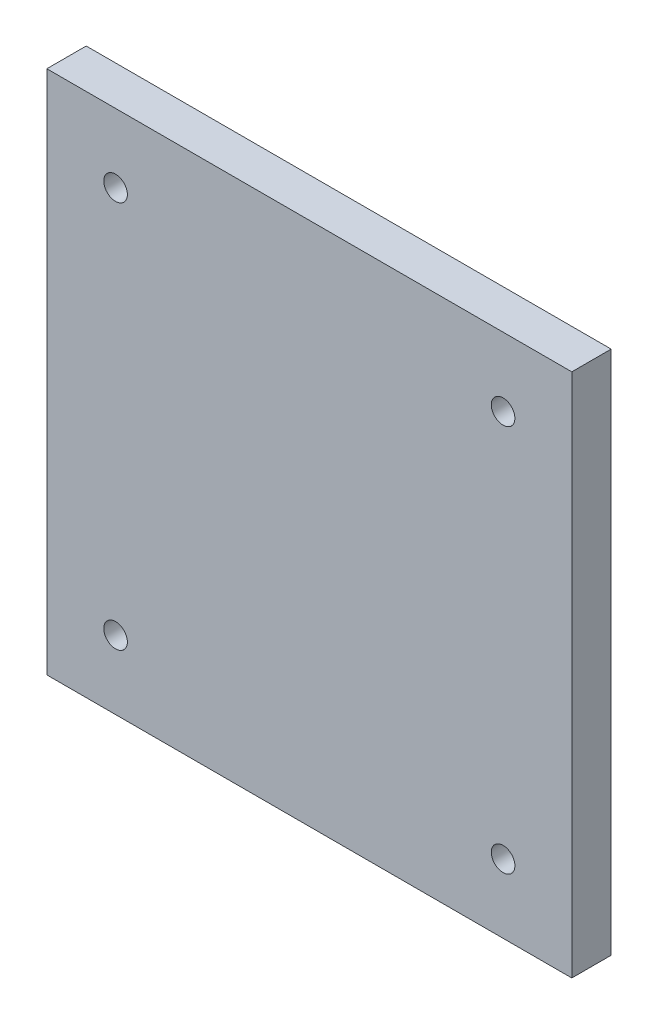
ISO-10303-21;
HEADER;
FILE_DESCRIPTION(('STEP AP214'),'2;1');
FILE_NAME('part.step','',(''),(''),'','','');
FILE_SCHEMA(('AUTOMOTIVE_DESIGN { 1 0 10303 214 1 1 1 1 }'));
ENDSEC;
DATA;
#1=APPLICATION_CONTEXT('core data for automotive mechanical design processes');
#2=APPLICATION_PROTOCOL_DEFINITION('international standard','automotive_design',2000,#1);
#3=PRODUCT_CONTEXT('',#1,'mechanical');
#4=PRODUCT('Part','Part','',(#3));
#5=PRODUCT_RELATED_PRODUCT_CATEGORY('part','',(#4));
#6=PRODUCT_DEFINITION_FORMATION('','',#4);
#7=PRODUCT_DEFINITION_CONTEXT('part definition',#1,'design');
#8=PRODUCT_DEFINITION('design','',#6,#7);
#9=PRODUCT_DEFINITION_SHAPE('','',#8);
#10=(LENGTH_UNIT() NAMED_UNIT(*) SI_UNIT(.MILLI.,.METRE.));
#11=(NAMED_UNIT(*) PLANE_ANGLE_UNIT() SI_UNIT($,.RADIAN.));
#12=(NAMED_UNIT(*) SI_UNIT($,.STERADIAN.) SOLID_ANGLE_UNIT());
#13=UNCERTAINTY_MEASURE_WITH_UNIT(LENGTH_MEASURE(1.E-05),#10,'distance_accuracy_value','');
#14=(GEOMETRIC_REPRESENTATION_CONTEXT(3) GLOBAL_UNCERTAINTY_ASSIGNED_CONTEXT((#13)) GLOBAL_UNIT_ASSIGNED_CONTEXT((#10,
#11,#12)) REPRESENTATION_CONTEXT('',''));
#15=CARTESIAN_POINT('',(0.,0.,0.));
#16=DIRECTION('',(0.,0.,1.));
#17=DIRECTION('',(1.,0.,0.));
#18=AXIS2_PLACEMENT_3D('',#15,#16,#17);
#19=CARTESIAN_POINT('',(0.,0.,7.62));
#20=DIRECTION('',(0.,0.,1.));
#21=DIRECTION('',(1.,0.,0.));
#22=AXIS2_PLACEMENT_3D('',#19,#20,#21);
#23=PLANE('',#22);
#24=CARTESIAN_POINT('',(37.500052,-37.500052,7.62));
#25=DIRECTION('',(0.,0.,1.));
#26=DIRECTION('',(1.,0.,0.));
#27=AXIS2_PLACEMENT_3D('',#24,#25,#26);
#28=CIRCLE('',#27,2.28599999999999);
#29=CARTESIAN_POINT('',(39.786052,-37.500052,7.62));
#30=VERTEX_POINT('',#29);
#31=EDGE_CURVE('E121',#30,#30,#28,.T.);
#32=ORIENTED_EDGE('',*,*,#31,.F.);
#33=EDGE_LOOP('',(#32));
#34=FACE_BOUND('',#33,.T.);
#35=CARTESIAN_POINT('',(-37.500052,37.500052,7.62));
#36=DIRECTION('',(0.,0.,1.));
#37=DIRECTION('',(1.,0.,0.));
#38=AXIS2_PLACEMENT_3D('',#35,#36,#37);
#39=CIRCLE('',#38,2.28599999999999);
#40=CARTESIAN_POINT('',(-35.214052,37.500052,7.62));
#41=VERTEX_POINT('',#40);
#42=EDGE_CURVE('E100',#41,#41,#39,.T.);
#43=ORIENTED_EDGE('',*,*,#42,.F.);
#44=EDGE_LOOP('',(#43));
#45=FACE_BOUND('',#44,.T.);
#46=DIRECTION('',(0.,1.,0.));
#47=VECTOR('',#46,1.);
#48=CARTESIAN_POINT('',(50.8,50.8,7.62));
#49=LINE('',#48,#47);
#50=CARTESIAN_POINT('',(50.8,-50.8,7.62));
#51=VERTEX_POINT('',#50);
#52=CARTESIAN_POINT('',(50.8,50.8,7.62));
#53=VERTEX_POINT('',#52);
#54=EDGE_CURVE('E85',#51,#53,#49,.T.);
#55=ORIENTED_EDGE('',*,*,#54,.T.);
#56=DIRECTION('',(-1.,0.,0.));
#57=VECTOR('',#56,1.);
#58=CARTESIAN_POINT('',(-50.8,50.8,7.62));
#59=LINE('',#58,#57);
#60=CARTESIAN_POINT('',(-50.8,50.8,7.62));
#61=VERTEX_POINT('',#60);
#62=EDGE_CURVE('E80',#53,#61,#59,.T.);
#63=ORIENTED_EDGE('',*,*,#62,.T.);
#64=DIRECTION('',(0.,-1.,0.));
#65=VECTOR('',#64,1.);
#66=CARTESIAN_POINT('',(-50.8,50.8,7.62));
#67=LINE('',#66,#65);
#68=CARTESIAN_POINT('',(-50.8,-50.8,7.62));
#69=VERTEX_POINT('',#68);
#70=EDGE_CURVE('E83',#61,#69,#67,.T.);
#71=ORIENTED_EDGE('',*,*,#70,.T.);
#72=DIRECTION('',(1.,0.,0.));
#73=VECTOR('',#72,1.);
#74=CARTESIAN_POINT('',(-50.8,-50.8,7.62));
#75=LINE('',#74,#73);
#76=EDGE_CURVE('E50',#69,#51,#75,.T.);
#77=ORIENTED_EDGE('',*,*,#76,.T.);
#78=EDGE_LOOP('',(#55,#63,#71,#77));
#79=FACE_BOUND('',#78,.T.);
#80=CARTESIAN_POINT('',(37.500052,37.500052,7.62));
#81=DIRECTION('',(0.,0.,1.));
#82=DIRECTION('',(1.,0.,0.));
#83=AXIS2_PLACEMENT_3D('',#80,#81,#82);
#84=CIRCLE('',#83,2.28599999999999);
#85=CARTESIAN_POINT('',(39.786052,37.500052,7.62));
#86=VERTEX_POINT('',#85);
#87=EDGE_CURVE('E115',#86,#86,#84,.T.);
#88=ORIENTED_EDGE('',*,*,#87,.F.);
#89=EDGE_LOOP('',(#88));
#90=FACE_BOUND('',#89,.T.);
#91=CARTESIAN_POINT('',(-37.500052,-37.500052,7.62));
#92=DIRECTION('',(0.,0.,1.));
#93=DIRECTION('',(1.,0.,0.));
#94=AXIS2_PLACEMENT_3D('',#91,#92,#93);
#95=CIRCLE('',#94,2.28599999999999);
#96=CARTESIAN_POINT('',(-35.214052,-37.500052,7.62));
#97=VERTEX_POINT('',#96);
#98=EDGE_CURVE('E127',#97,#97,#95,.T.);
#99=ORIENTED_EDGE('',*,*,#98,.F.);
#100=EDGE_LOOP('',(#99));
#101=FACE_BOUND('',#100,.T.);
#102=ADVANCED_FACE('F33',(#34,#45,#79,#90,#101),#23,.T.);
#103=CARTESIAN_POINT('',(0.,0.,0.));
#104=DIRECTION('',(0.,0.,1.));
#105=DIRECTION('',(1.,0.,0.));
#106=AXIS2_PLACEMENT_3D('',#103,#104,#105);
#107=PLANE('',#106);
#108=DIRECTION('',(0.,1.,0.));
#109=VECTOR('',#108,1.);
#110=CARTESIAN_POINT('',(50.8,50.8,0.));
#111=LINE('',#110,#109);
#112=CARTESIAN_POINT('',(50.8,-50.8,0.));
#113=VERTEX_POINT('',#112);
#114=CARTESIAN_POINT('',(50.8,50.8,0.));
#115=VERTEX_POINT('',#114);
#116=EDGE_CURVE('E97',#113,#115,#111,.T.);
#117=ORIENTED_EDGE('',*,*,#116,.F.);
#118=DIRECTION('',(1.,0.,0.));
#119=VECTOR('',#118,1.);
#120=CARTESIAN_POINT('',(-50.8,-50.8,0.));
#121=LINE('',#120,#119);
#122=CARTESIAN_POINT('',(-50.8,-50.8,0.));
#123=VERTEX_POINT('',#122);
#124=EDGE_CURVE('E73',#123,#113,#121,.T.);
#125=ORIENTED_EDGE('',*,*,#124,.F.);
#126=DIRECTION('',(0.,-1.,0.));
#127=VECTOR('',#126,1.);
#128=CARTESIAN_POINT('',(-50.8,50.8,0.));
#129=LINE('',#128,#127);
#130=CARTESIAN_POINT('',(-50.8,50.8,0.));
#131=VERTEX_POINT('',#130);
#132=EDGE_CURVE('E67',#131,#123,#129,.T.);
#133=ORIENTED_EDGE('',*,*,#132,.F.);
#134=DIRECTION('',(-1.,0.,0.));
#135=VECTOR('',#134,1.);
#136=CARTESIAN_POINT('',(-50.8,50.8,0.));
#137=LINE('',#136,#135);
#138=EDGE_CURVE('E89',#115,#131,#137,.T.);
#139=ORIENTED_EDGE('',*,*,#138,.F.);
#140=EDGE_LOOP('',(#117,#125,#133,#139));
#141=FACE_BOUND('',#140,.T.);
#142=CARTESIAN_POINT('',(-37.500052,37.500052,0.));
#143=DIRECTION('',(0.,0.,1.));
#144=DIRECTION('',(1.,0.,0.));
#145=AXIS2_PLACEMENT_3D('',#142,#143,#144);
#146=CIRCLE('',#145,2.28599999999999);
#147=CARTESIAN_POINT('',(-35.214052,37.500052,0.));
#148=VERTEX_POINT('',#147);
#149=EDGE_CURVE('E112',#148,#148,#146,.T.);
#150=ORIENTED_EDGE('',*,*,#149,.T.);
#151=EDGE_LOOP('',(#150));
#152=FACE_BOUND('',#151,.T.);
#153=CARTESIAN_POINT('',(37.500052,37.500052,0.));
#154=DIRECTION('',(0.,0.,1.));
#155=DIRECTION('',(1.,0.,0.));
#156=AXIS2_PLACEMENT_3D('',#153,#154,#155);
#157=CIRCLE('',#156,2.28599999999999);
#158=CARTESIAN_POINT('',(39.786052,37.500052,0.));
#159=VERTEX_POINT('',#158);
#160=EDGE_CURVE('E118',#159,#159,#157,.T.);
#161=ORIENTED_EDGE('',*,*,#160,.T.);
#162=EDGE_LOOP('',(#161));
#163=FACE_BOUND('',#162,.T.);
#164=CARTESIAN_POINT('',(37.500052,-37.500052,0.));
#165=DIRECTION('',(0.,0.,1.));
#166=DIRECTION('',(1.,0.,0.));
#167=AXIS2_PLACEMENT_3D('',#164,#165,#166);
#168=CIRCLE('',#167,2.28599999999999);
#169=CARTESIAN_POINT('',(39.786052,-37.500052,0.));
#170=VERTEX_POINT('',#169);
#171=EDGE_CURVE('E124',#170,#170,#168,.T.);
#172=ORIENTED_EDGE('',*,*,#171,.T.);
#173=EDGE_LOOP('',(#172));
#174=FACE_BOUND('',#173,.T.);
#175=CARTESIAN_POINT('',(-37.500052,-37.500052,0.));
#176=DIRECTION('',(0.,0.,1.));
#177=DIRECTION('',(1.,0.,0.));
#178=AXIS2_PLACEMENT_3D('',#175,#176,#177);
#179=CIRCLE('',#178,2.28599999999999);
#180=CARTESIAN_POINT('',(-35.214052,-37.500052,0.));
#181=VERTEX_POINT('',#180);
#182=EDGE_CURVE('E130',#181,#181,#179,.T.);
#183=ORIENTED_EDGE('',*,*,#182,.T.);
#184=EDGE_LOOP('',(#183));
#185=FACE_BOUND('',#184,.T.);
#186=ADVANCED_FACE('F108',(#141,#152,#163,#174,#185),#107,.F.);
#187=CARTESIAN_POINT('',(50.8,50.8,7.62));
#188=DIRECTION('',(-1.,0.,0.));
#189=DIRECTION('',(0.,-1.,0.));
#190=AXIS2_PLACEMENT_3D('',#187,#188,#189);
#191=PLANE('',#190);
#192=ORIENTED_EDGE('',*,*,#116,.T.);
#193=DIRECTION('',(0.,0.,-1.));
#194=VECTOR('',#193,1.);
#195=CARTESIAN_POINT('',(50.8,50.8,7.62));
#196=LINE('',#195,#194);
#197=EDGE_CURVE('E11',#53,#115,#196,.T.);
#198=ORIENTED_EDGE('',*,*,#197,.F.);
#199=ORIENTED_EDGE('',*,*,#54,.F.);
#200=DIRECTION('',(0.,0.,-1.));
#201=VECTOR('',#200,1.);
#202=CARTESIAN_POINT('',(50.8,-50.8,7.62));
#203=LINE('',#202,#201);
#204=EDGE_CURVE('E93',#51,#113,#203,.T.);
#205=ORIENTED_EDGE('',*,*,#204,.T.);
#206=EDGE_LOOP('',(#192,#198,#199,#205));
#207=FACE_BOUND('',#206,.T.);
#208=ADVANCED_FACE('F35',(#207),#191,.F.);
#209=CARTESIAN_POINT('',(-50.8,50.8,7.62));
#210=DIRECTION('',(0.,-1.,0.));
#211=DIRECTION('',(0.,0.,-1.));
#212=AXIS2_PLACEMENT_3D('',#209,#210,#211);
#213=PLANE('',#212);
#214=ORIENTED_EDGE('',*,*,#138,.T.);
#215=DIRECTION('',(0.,0.,-1.));
#216=VECTOR('',#215,1.);
#217=CARTESIAN_POINT('',(-50.8,50.8,7.62));
#218=LINE('',#217,#216);
#219=EDGE_CURVE('E42',#61,#131,#218,.T.);
#220=ORIENTED_EDGE('',*,*,#219,.F.);
#221=ORIENTED_EDGE('',*,*,#62,.F.);
#222=ORIENTED_EDGE('',*,*,#197,.T.);
#223=EDGE_LOOP('',(#214,#220,#221,#222));
#224=FACE_BOUND('',#223,.T.);
#225=ADVANCED_FACE('F88',(#224),#213,.F.);
#226=CARTESIAN_POINT('',(-50.8,50.8,7.62));
#227=DIRECTION('',(1.,0.,0.));
#228=DIRECTION('',(0.,1.,0.));
#229=AXIS2_PLACEMENT_3D('',#226,#227,#228);
#230=PLANE('',#229);
#231=ORIENTED_EDGE('',*,*,#132,.T.);
#232=DIRECTION('',(0.,0.,-1.));
#233=VECTOR('',#232,1.);
#234=CARTESIAN_POINT('',(-50.8,-50.8,7.62));
#235=LINE('',#234,#233);
#236=EDGE_CURVE('E90',#69,#123,#235,.T.);
#237=ORIENTED_EDGE('',*,*,#236,.F.);
#238=ORIENTED_EDGE('',*,*,#70,.F.);
#239=ORIENTED_EDGE('',*,*,#219,.T.);
#240=EDGE_LOOP('',(#231,#237,#238,#239));
#241=FACE_BOUND('',#240,.T.);
#242=ADVANCED_FACE('F91',(#241),#230,.F.);
#243=CARTESIAN_POINT('',(-50.8,-50.8,7.62));
#244=DIRECTION('',(0.,1.,0.));
#245=DIRECTION('',(0.,0.,1.));
#246=AXIS2_PLACEMENT_3D('',#243,#244,#245);
#247=PLANE('',#246);
#248=ORIENTED_EDGE('',*,*,#124,.T.);
#249=ORIENTED_EDGE('',*,*,#204,.F.);
#250=ORIENTED_EDGE('',*,*,#76,.F.);
#251=ORIENTED_EDGE('',*,*,#236,.T.);
#252=EDGE_LOOP('',(#248,#249,#250,#251));
#253=FACE_BOUND('',#252,.T.);
#254=ADVANCED_FACE('F105',(#253),#247,.F.);
#255=CARTESIAN_POINT('',(-37.500052,37.500052,7.62));
#256=DIRECTION('',(0.,0.,-1.));
#257=DIRECTION('',(-1.,0.,0.));
#258=AXIS2_PLACEMENT_3D('',#255,#256,#257);
#259=CYLINDRICAL_SURFACE('',#258,2.28599999999999);
#260=ORIENTED_EDGE('',*,*,#42,.T.);
#261=EDGE_LOOP('',(#260));
#262=FACE_BOUND('',#261,.T.);
#263=ORIENTED_EDGE('',*,*,#149,.F.);
#264=EDGE_LOOP('',(#263));
#265=FACE_BOUND('',#264,.T.);
#266=ADVANCED_FACE('F149',(#262,#265),#259,.F.);
#267=CARTESIAN_POINT('',(37.500052,37.500052,7.62));
#268=DIRECTION('',(0.,0.,-1.));
#269=DIRECTION('',(-1.,0.,0.));
#270=AXIS2_PLACEMENT_3D('',#267,#268,#269);
#271=CYLINDRICAL_SURFACE('',#270,2.28599999999999);
#272=ORIENTED_EDGE('',*,*,#87,.T.);
#273=EDGE_LOOP('',(#272));
#274=FACE_BOUND('',#273,.T.);
#275=ORIENTED_EDGE('',*,*,#160,.F.);
#276=EDGE_LOOP('',(#275));
#277=FACE_BOUND('',#276,.T.);
#278=ADVANCED_FACE('F195',(#274,#277),#271,.F.);
#279=CARTESIAN_POINT('',(37.500052,-37.500052,7.62));
#280=DIRECTION('',(0.,0.,-1.));
#281=DIRECTION('',(-1.,0.,0.));
#282=AXIS2_PLACEMENT_3D('',#279,#280,#281);
#283=CYLINDRICAL_SURFACE('',#282,2.28599999999999);
#284=ORIENTED_EDGE('',*,*,#31,.T.);
#285=EDGE_LOOP('',(#284));
#286=FACE_BOUND('',#285,.T.);
#287=ORIENTED_EDGE('',*,*,#171,.F.);
#288=EDGE_LOOP('',(#287));
#289=FACE_BOUND('',#288,.T.);
#290=ADVANCED_FACE('F203',(#286,#289),#283,.F.);
#291=CARTESIAN_POINT('',(-37.500052,-37.500052,7.62));
#292=DIRECTION('',(0.,0.,-1.));
#293=DIRECTION('',(-1.,0.,0.));
#294=AXIS2_PLACEMENT_3D('',#291,#292,#293);
#295=CYLINDRICAL_SURFACE('',#294,2.28599999999999);
#296=ORIENTED_EDGE('',*,*,#98,.T.);
#297=EDGE_LOOP('',(#296));
#298=FACE_BOUND('',#297,.T.);
#299=ORIENTED_EDGE('',*,*,#182,.F.);
#300=EDGE_LOOP('',(#299));
#301=FACE_BOUND('',#300,.T.);
#302=ADVANCED_FACE('F136',(#298,#301),#295,.F.);
#303=CLOSED_SHELL('',(#102,#186,#208,#225,#242,#254,#266,#278,#290,#302));
#304=MANIFOLD_SOLID_BREP('B2',#303);
#305=ADVANCED_BREP_SHAPE_REPRESENTATION('',(#18,#304),#14);
#306=SHAPE_DEFINITION_REPRESENTATION(#9,#305);
ENDSEC;
END-ISO-10303-21;
